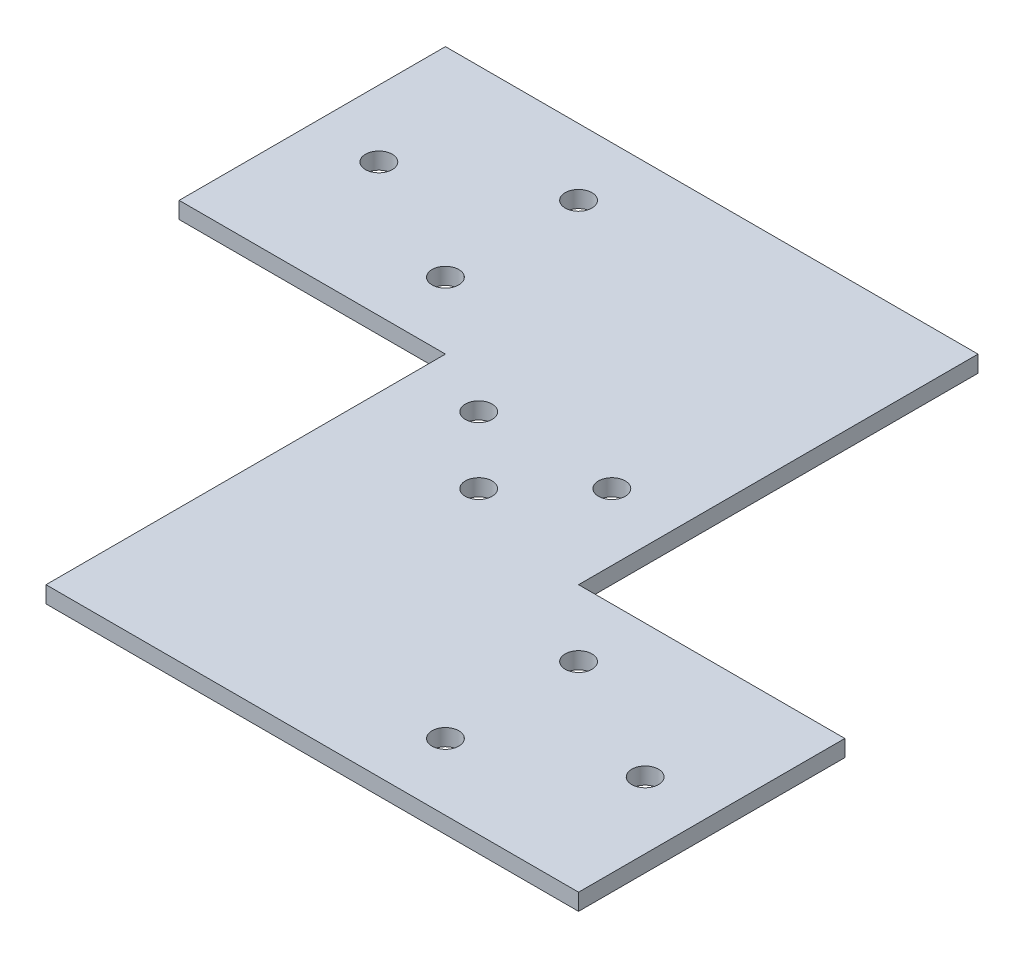
ISO-10303-21;
HEADER;
FILE_DESCRIPTION(('STEP AP214'),'2;1');
FILE_NAME('part.step','',(''),(''),'','','');
FILE_SCHEMA(('AUTOMOTIVE_DESIGN { 1 0 10303 214 1 1 1 1 }'));
ENDSEC;
DATA;
#1=APPLICATION_CONTEXT('core data for automotive mechanical design processes');
#2=APPLICATION_PROTOCOL_DEFINITION('international standard','automotive_design',2000,#1);
#3=PRODUCT_CONTEXT('',#1,'mechanical');
#4=PRODUCT('Part','Part','',(#3));
#5=PRODUCT_RELATED_PRODUCT_CATEGORY('part','',(#4));
#6=PRODUCT_DEFINITION_FORMATION('','',#4);
#7=PRODUCT_DEFINITION_CONTEXT('part definition',#1,'design');
#8=PRODUCT_DEFINITION('design','',#6,#7);
#9=PRODUCT_DEFINITION_SHAPE('','',#8);
#10=(LENGTH_UNIT() NAMED_UNIT(*) SI_UNIT(.MILLI.,.METRE.));
#11=(NAMED_UNIT(*) PLANE_ANGLE_UNIT() SI_UNIT($,.RADIAN.));
#12=(NAMED_UNIT(*) SI_UNIT($,.STERADIAN.) SOLID_ANGLE_UNIT());
#13=UNCERTAINTY_MEASURE_WITH_UNIT(LENGTH_MEASURE(1.E-05),#10,'distance_accuracy_value','');
#14=(GEOMETRIC_REPRESENTATION_CONTEXT(3) GLOBAL_UNCERTAINTY_ASSIGNED_CONTEXT((#13)) GLOBAL_UNIT_ASSIGNED_CONTEXT((#10,
#11,#12)) REPRESENTATION_CONTEXT('',''));
#15=CARTESIAN_POINT('',(0.,0.,0.));
#16=DIRECTION('',(0.,0.,1.));
#17=DIRECTION('',(1.,0.,0.));
#18=AXIS2_PLACEMENT_3D('',#15,#16,#17);
#19=CARTESIAN_POINT('',(0.,3.175,0.));
#20=DIRECTION('',(0.,-1.,0.));
#21=DIRECTION('',(0.,0.,-1.));
#22=AXIS2_PLACEMENT_3D('',#19,#20,#21);
#23=PLANE('',#22);
#24=DIRECTION('',(0.,0.,1.));
#25=VECTOR('',#24,1.);
#26=CARTESIAN_POINT('',(0.,3.175,0.));
#27=LINE('',#26,#25);
#28=CARTESIAN_POINT('',(0.,3.175,-50.8));
#29=VERTEX_POINT('',#28);
#30=CARTESIAN_POINT('',(0.,3.175,0.));
#31=VERTEX_POINT('',#30);
#32=EDGE_CURVE('E145',#29,#31,#27,.T.);
#33=ORIENTED_EDGE('',*,*,#32,.T.);
#34=DIRECTION('',(1.,0.,0.));
#35=VECTOR('',#34,1.);
#36=CARTESIAN_POINT('',(0.,3.175,0.));
#37=LINE('',#36,#35);
#38=CARTESIAN_POINT('',(50.8,3.175,0.));
#39=VERTEX_POINT('',#38);
#40=EDGE_CURVE('E92',#31,#39,#37,.T.);
#41=ORIENTED_EDGE('',*,*,#40,.T.);
#42=DIRECTION('',(0.,0.,1.));
#43=VECTOR('',#42,1.);
#44=CARTESIAN_POINT('',(50.8,3.175,0.));
#45=LINE('',#44,#43);
#46=CARTESIAN_POINT('',(50.8,3.175,76.2));
#47=VERTEX_POINT('',#46);
#48=EDGE_CURVE('E160',#39,#47,#45,.T.);
#49=ORIENTED_EDGE('',*,*,#48,.T.);
#50=DIRECTION('',(1.,0.,0.));
#51=VECTOR('',#50,1.);
#52=CARTESIAN_POINT('',(50.8,3.175,76.2));
#53=LINE('',#52,#51);
#54=CARTESIAN_POINT('',(152.4,3.175,76.2));
#55=VERTEX_POINT('',#54);
#56=EDGE_CURVE('E172',#47,#55,#53,.T.);
#57=ORIENTED_EDGE('',*,*,#56,.T.);
#58=DIRECTION('',(0.,0.,-1.));
#59=VECTOR('',#58,1.);
#60=CARTESIAN_POINT('',(152.4,3.175,76.2));
#61=LINE('',#60,#59);
#62=CARTESIAN_POINT('',(152.4,3.175,25.4));
#63=VERTEX_POINT('',#62);
#64=EDGE_CURVE('E111',#55,#63,#61,.T.);
#65=ORIENTED_EDGE('',*,*,#64,.T.);
#66=DIRECTION('',(-1.,0.,0.));
#67=VECTOR('',#66,1.);
#68=CARTESIAN_POINT('',(101.6,3.175,25.4));
#69=LINE('',#68,#67);
#70=CARTESIAN_POINT('',(101.6,3.175,25.4));
#71=VERTEX_POINT('',#70);
#72=EDGE_CURVE('E105',#63,#71,#69,.T.);
#73=ORIENTED_EDGE('',*,*,#72,.T.);
#74=DIRECTION('',(0.,0.,-1.));
#75=VECTOR('',#74,1.);
#76=CARTESIAN_POINT('',(101.6,3.175,-50.8));
#77=LINE('',#76,#75);
#78=CARTESIAN_POINT('',(101.6,3.175,-50.8));
#79=VERTEX_POINT('',#78);
#80=EDGE_CURVE('E109',#71,#79,#77,.T.);
#81=ORIENTED_EDGE('',*,*,#80,.T.);
#82=DIRECTION('',(-1.,0.,0.));
#83=VECTOR('',#82,1.);
#84=CARTESIAN_POINT('',(0.,3.175,-50.8));
#85=LINE('',#84,#83);
#86=EDGE_CURVE('E49',#79,#29,#85,.T.);
#87=ORIENTED_EDGE('',*,*,#86,.T.);
#88=EDGE_LOOP('',(#33,#41,#49,#57,#65,#73,#81,#87));
#89=FACE_BOUND('',#88,.T.);
#90=CARTESIAN_POINT('',(12.7,3.175,-25.4));
#91=DIRECTION('',(0.,1.,0.));
#92=DIRECTION('',(0.,0.,1.));
#93=AXIS2_PLACEMENT_3D('',#90,#91,#92);
#94=CIRCLE('',#93,2.5527);
#95=CARTESIAN_POINT('',(12.7,3.175,-22.8473));
#96=VERTEX_POINT('',#95);
#97=EDGE_CURVE('E133',#96,#96,#94,.T.);
#98=ORIENTED_EDGE('',*,*,#97,.F.);
#99=EDGE_LOOP('',(#98));
#100=FACE_BOUND('',#99,.T.);
#101=CARTESIAN_POINT('',(38.1,3.175,-12.7));
#102=DIRECTION('',(0.,1.,0.));
#103=DIRECTION('',(0.,0.,1.));
#104=AXIS2_PLACEMENT_3D('',#101,#102,#103);
#105=CIRCLE('',#104,2.5527);
#106=CARTESIAN_POINT('',(38.1,3.175,-10.1473));
#107=VERTEX_POINT('',#106);
#108=EDGE_CURVE('E181',#107,#107,#105,.T.);
#109=ORIENTED_EDGE('',*,*,#108,.F.);
#110=EDGE_LOOP('',(#109));
#111=FACE_BOUND('',#110,.T.);
#112=CARTESIAN_POINT('',(38.1,3.175,-38.1));
#113=DIRECTION('',(0.,1.,0.));
#114=DIRECTION('',(0.,0.,1.));
#115=AXIS2_PLACEMENT_3D('',#112,#113,#114);
#116=CIRCLE('',#115,2.55269999999999);
#117=CARTESIAN_POINT('',(38.1,3.175,-35.5473));
#118=VERTEX_POINT('',#117);
#119=EDGE_CURVE('E187',#118,#118,#116,.T.);
#120=ORIENTED_EDGE('',*,*,#119,.F.);
#121=EDGE_LOOP('',(#120));
#122=FACE_BOUND('',#121,.T.);
#123=CARTESIAN_POINT('',(139.7,3.175,50.8));
#124=DIRECTION('',(0.,1.,0.));
#125=DIRECTION('',(0.,0.,1.));
#126=AXIS2_PLACEMENT_3D('',#123,#124,#125);
#127=CIRCLE('',#126,2.55269999999998);
#128=CARTESIAN_POINT('',(139.7,3.175,53.3527));
#129=VERTEX_POINT('',#128);
#130=EDGE_CURVE('E193',#129,#129,#127,.T.);
#131=ORIENTED_EDGE('',*,*,#130,.F.);
#132=EDGE_LOOP('',(#131));
#133=FACE_BOUND('',#132,.T.);
#134=CARTESIAN_POINT('',(114.3,3.175,38.1));
#135=DIRECTION('',(0.,1.,0.));
#136=DIRECTION('',(0.,0.,1.));
#137=AXIS2_PLACEMENT_3D('',#134,#135,#136);
#138=CIRCLE('',#137,2.55269999999998);
#139=CARTESIAN_POINT('',(114.3,3.175,40.6527));
#140=VERTEX_POINT('',#139);
#141=EDGE_CURVE('E199',#140,#140,#138,.T.);
#142=ORIENTED_EDGE('',*,*,#141,.F.);
#143=EDGE_LOOP('',(#142));
#144=FACE_BOUND('',#143,.T.);
#145=CARTESIAN_POINT('',(114.3,3.175,63.5));
#146=DIRECTION('',(0.,1.,0.));
#147=DIRECTION('',(0.,0.,1.));
#148=AXIS2_PLACEMENT_3D('',#145,#146,#147);
#149=CIRCLE('',#148,2.55269999999998);
#150=CARTESIAN_POINT('',(114.3,3.175,66.0527));
#151=VERTEX_POINT('',#150);
#152=EDGE_CURVE('E205',#151,#151,#149,.T.);
#153=ORIENTED_EDGE('',*,*,#152,.F.);
#154=EDGE_LOOP('',(#153));
#155=FACE_BOUND('',#154,.T.);
#156=CARTESIAN_POINT('',(63.5,3.175,6.35));
#157=DIRECTION('',(0.,1.,0.));
#158=DIRECTION('',(0.,0.,1.));
#159=AXIS2_PLACEMENT_3D('',#156,#157,#158);
#160=CIRCLE('',#159,2.55270000000001);
#161=CARTESIAN_POINT('',(63.5,3.175,8.90270000000001));
#162=VERTEX_POINT('',#161);
#163=EDGE_CURVE('E211',#162,#162,#160,.T.);
#164=ORIENTED_EDGE('',*,*,#163,.F.);
#165=EDGE_LOOP('',(#164));
#166=FACE_BOUND('',#165,.T.);
#167=CARTESIAN_POINT('',(88.9,3.175,6.35));
#168=DIRECTION('',(0.,1.,0.));
#169=DIRECTION('',(0.,0.,1.));
#170=AXIS2_PLACEMENT_3D('',#167,#168,#169);
#171=CIRCLE('',#170,2.55270000000001);
#172=CARTESIAN_POINT('',(88.9,3.175,8.90270000000001));
#173=VERTEX_POINT('',#172);
#174=EDGE_CURVE('E217',#173,#173,#171,.T.);
#175=ORIENTED_EDGE('',*,*,#174,.F.);
#176=EDGE_LOOP('',(#175));
#177=FACE_BOUND('',#176,.T.);
#178=CARTESIAN_POINT('',(76.2,3.175,19.05));
#179=DIRECTION('',(0.,1.,0.));
#180=DIRECTION('',(0.,0.,1.));
#181=AXIS2_PLACEMENT_3D('',#178,#179,#180);
#182=CIRCLE('',#181,2.55270000000001);
#183=CARTESIAN_POINT('',(76.2,3.175,21.6027));
#184=VERTEX_POINT('',#183);
#185=EDGE_CURVE('E223',#184,#184,#182,.T.);
#186=ORIENTED_EDGE('',*,*,#185,.F.);
#187=EDGE_LOOP('',(#186));
#188=FACE_BOUND('',#187,.T.);
#189=ADVANCED_FACE('F32',(#89,#100,#111,#122,#133,#144,#155,#166,#177,#188),#23,.F.);
#190=CARTESIAN_POINT('',(0.,0.,0.));
#191=DIRECTION('',(0.,-1.,0.));
#192=DIRECTION('',(0.,0.,-1.));
#193=AXIS2_PLACEMENT_3D('',#190,#191,#192);
#194=PLANE('',#193);
#195=CARTESIAN_POINT('',(88.9,0.,6.35));
#196=DIRECTION('',(0.,1.,0.));
#197=DIRECTION('',(0.,0.,1.));
#198=AXIS2_PLACEMENT_3D('',#195,#196,#197);
#199=CIRCLE('',#198,2.55270000000001);
#200=CARTESIAN_POINT('',(88.9,0.,8.90270000000001));
#201=VERTEX_POINT('',#200);
#202=EDGE_CURVE('E220',#201,#201,#199,.T.);
#203=ORIENTED_EDGE('',*,*,#202,.T.);
#204=EDGE_LOOP('',(#203));
#205=FACE_BOUND('',#204,.T.);
#206=CARTESIAN_POINT('',(114.3,0.,63.5));
#207=DIRECTION('',(0.,1.,0.));
#208=DIRECTION('',(0.,0.,1.));
#209=AXIS2_PLACEMENT_3D('',#206,#207,#208);
#210=CIRCLE('',#209,2.55269999999998);
#211=CARTESIAN_POINT('',(114.3,0.,66.0527));
#212=VERTEX_POINT('',#211);
#213=EDGE_CURVE('E208',#212,#212,#210,.T.);
#214=ORIENTED_EDGE('',*,*,#213,.T.);
#215=EDGE_LOOP('',(#214));
#216=FACE_BOUND('',#215,.T.);
#217=CARTESIAN_POINT('',(139.7,0.,50.8));
#218=DIRECTION('',(0.,1.,0.));
#219=DIRECTION('',(0.,0.,1.));
#220=AXIS2_PLACEMENT_3D('',#217,#218,#219);
#221=CIRCLE('',#220,2.55269999999998);
#222=CARTESIAN_POINT('',(139.7,0.,53.3527));
#223=VERTEX_POINT('',#222);
#224=EDGE_CURVE('E196',#223,#223,#221,.T.);
#225=ORIENTED_EDGE('',*,*,#224,.T.);
#226=EDGE_LOOP('',(#225));
#227=FACE_BOUND('',#226,.T.);
#228=CARTESIAN_POINT('',(38.1,0.,-12.7));
#229=DIRECTION('',(0.,1.,0.));
#230=DIRECTION('',(0.,0.,1.));
#231=AXIS2_PLACEMENT_3D('',#228,#229,#230);
#232=CIRCLE('',#231,2.5527);
#233=CARTESIAN_POINT('',(38.1,0.,-10.1473));
#234=VERTEX_POINT('',#233);
#235=EDGE_CURVE('E184',#234,#234,#232,.T.);
#236=ORIENTED_EDGE('',*,*,#235,.T.);
#237=EDGE_LOOP('',(#236));
#238=FACE_BOUND('',#237,.T.);
#239=DIRECTION('',(0.,0.,1.));
#240=VECTOR('',#239,1.);
#241=CARTESIAN_POINT('',(0.,0.,0.));
#242=LINE('',#241,#240);
#243=CARTESIAN_POINT('',(0.,0.,-50.8));
#244=VERTEX_POINT('',#243);
#245=CARTESIAN_POINT('',(0.,0.,0.));
#246=VERTEX_POINT('',#245);
#247=EDGE_CURVE('E129',#244,#246,#242,.T.);
#248=ORIENTED_EDGE('',*,*,#247,.F.);
#249=DIRECTION('',(-1.,0.,0.));
#250=VECTOR('',#249,1.);
#251=CARTESIAN_POINT('',(0.,0.,-50.8));
#252=LINE('',#251,#250);
#253=CARTESIAN_POINT('',(101.6,0.,-50.8));
#254=VERTEX_POINT('',#253);
#255=EDGE_CURVE('E84',#254,#244,#252,.T.);
#256=ORIENTED_EDGE('',*,*,#255,.F.);
#257=DIRECTION('',(0.,0.,-1.));
#258=VECTOR('',#257,1.);
#259=CARTESIAN_POINT('',(101.6,0.,-50.8));
#260=LINE('',#259,#258);
#261=CARTESIAN_POINT('',(101.6,0.,25.4));
#262=VERTEX_POINT('',#261);
#263=EDGE_CURVE('E78',#262,#254,#260,.T.);
#264=ORIENTED_EDGE('',*,*,#263,.F.);
#265=DIRECTION('',(-1.,0.,0.));
#266=VECTOR('',#265,1.);
#267=CARTESIAN_POINT('',(101.6,0.,25.4));
#268=LINE('',#267,#266);
#269=CARTESIAN_POINT('',(152.4,0.,25.4));
#270=VERTEX_POINT('',#269);
#271=EDGE_CURVE('E119',#270,#262,#268,.T.);
#272=ORIENTED_EDGE('',*,*,#271,.F.);
#273=DIRECTION('',(0.,0.,-1.));
#274=VECTOR('',#273,1.);
#275=CARTESIAN_POINT('',(152.4,0.,76.2));
#276=LINE('',#275,#274);
#277=CARTESIAN_POINT('',(152.4,0.,76.2));
#278=VERTEX_POINT('',#277);
#279=EDGE_CURVE('E140',#278,#270,#276,.T.);
#280=ORIENTED_EDGE('',*,*,#279,.F.);
#281=DIRECTION('',(1.,0.,0.));
#282=VECTOR('',#281,1.);
#283=CARTESIAN_POINT('',(101.6,0.,76.2));
#284=LINE('',#283,#282);
#285=CARTESIAN_POINT('',(50.8,0.,76.2));
#286=VERTEX_POINT('',#285);
#287=EDGE_CURVE('E138',#286,#278,#284,.T.);
#288=ORIENTED_EDGE('',*,*,#287,.F.);
#289=DIRECTION('',(0.,0.,1.));
#290=VECTOR('',#289,1.);
#291=CARTESIAN_POINT('',(50.8,0.,0.));
#292=LINE('',#291,#290);
#293=CARTESIAN_POINT('',(50.8,0.,0.));
#294=VERTEX_POINT('',#293);
#295=EDGE_CURVE('E135',#294,#286,#292,.T.);
#296=ORIENTED_EDGE('',*,*,#295,.F.);
#297=DIRECTION('',(1.,0.,0.));
#298=VECTOR('',#297,1.);
#299=CARTESIAN_POINT('',(0.,0.,0.));
#300=LINE('',#299,#298);
#301=EDGE_CURVE('E132',#246,#294,#300,.T.);
#302=ORIENTED_EDGE('',*,*,#301,.F.);
#303=EDGE_LOOP('',(#248,#256,#264,#272,#280,#288,#296,#302));
#304=FACE_BOUND('',#303,.T.);
#305=CARTESIAN_POINT('',(12.7,0.,-25.4));
#306=DIRECTION('',(0.,1.,0.));
#307=DIRECTION('',(0.,0.,1.));
#308=AXIS2_PLACEMENT_3D('',#305,#306,#307);
#309=CIRCLE('',#308,2.5527);
#310=CARTESIAN_POINT('',(12.7,0.,-22.8473));
#311=VERTEX_POINT('',#310);
#312=EDGE_CURVE('E178',#311,#311,#309,.T.);
#313=ORIENTED_EDGE('',*,*,#312,.T.);
#314=EDGE_LOOP('',(#313));
#315=FACE_BOUND('',#314,.T.);
#316=CARTESIAN_POINT('',(38.1,0.,-38.1));
#317=DIRECTION('',(0.,1.,0.));
#318=DIRECTION('',(0.,0.,1.));
#319=AXIS2_PLACEMENT_3D('',#316,#317,#318);
#320=CIRCLE('',#319,2.55269999999999);
#321=CARTESIAN_POINT('',(38.1,0.,-35.5473));
#322=VERTEX_POINT('',#321);
#323=EDGE_CURVE('E190',#322,#322,#320,.T.);
#324=ORIENTED_EDGE('',*,*,#323,.T.);
#325=EDGE_LOOP('',(#324));
#326=FACE_BOUND('',#325,.T.);
#327=CARTESIAN_POINT('',(114.3,0.,38.1));
#328=DIRECTION('',(0.,1.,0.));
#329=DIRECTION('',(0.,0.,1.));
#330=AXIS2_PLACEMENT_3D('',#327,#328,#329);
#331=CIRCLE('',#330,2.55269999999998);
#332=CARTESIAN_POINT('',(114.3,0.,40.6527));
#333=VERTEX_POINT('',#332);
#334=EDGE_CURVE('E202',#333,#333,#331,.T.);
#335=ORIENTED_EDGE('',*,*,#334,.T.);
#336=EDGE_LOOP('',(#335));
#337=FACE_BOUND('',#336,.T.);
#338=CARTESIAN_POINT('',(63.5,0.,6.35));
#339=DIRECTION('',(0.,1.,0.));
#340=DIRECTION('',(0.,0.,1.));
#341=AXIS2_PLACEMENT_3D('',#338,#339,#340);
#342=CIRCLE('',#341,2.55270000000001);
#343=CARTESIAN_POINT('',(63.5,0.,8.90270000000001));
#344=VERTEX_POINT('',#343);
#345=EDGE_CURVE('E214',#344,#344,#342,.T.);
#346=ORIENTED_EDGE('',*,*,#345,.T.);
#347=EDGE_LOOP('',(#346));
#348=FACE_BOUND('',#347,.T.);
#349=CARTESIAN_POINT('',(76.2,0.,19.05));
#350=DIRECTION('',(0.,1.,0.));
#351=DIRECTION('',(0.,0.,1.));
#352=AXIS2_PLACEMENT_3D('',#349,#350,#351);
#353=CIRCLE('',#352,2.55270000000001);
#354=CARTESIAN_POINT('',(76.2,0.,21.6027));
#355=VERTEX_POINT('',#354);
#356=EDGE_CURVE('E226',#355,#355,#353,.T.);
#357=ORIENTED_EDGE('',*,*,#356,.T.);
#358=EDGE_LOOP('',(#357));
#359=FACE_BOUND('',#358,.T.);
#360=ADVANCED_FACE('F163',(#205,#216,#227,#238,#304,#315,#326,#337,#348,#359),#194,.T.);
#361=CARTESIAN_POINT('',(0.,3.175,0.));
#362=DIRECTION('',(1.,0.,0.));
#363=DIRECTION('',(0.,0.,-1.));
#364=AXIS2_PLACEMENT_3D('',#361,#362,#363);
#365=PLANE('',#364);
#366=ORIENTED_EDGE('',*,*,#247,.T.);
#367=DIRECTION('',(0.,-1.,0.));
#368=VECTOR('',#367,1.);
#369=CARTESIAN_POINT('',(0.,3.175,0.));
#370=LINE('',#369,#368);
#371=EDGE_CURVE('E11',#31,#246,#370,.T.);
#372=ORIENTED_EDGE('',*,*,#371,.F.);
#373=ORIENTED_EDGE('',*,*,#32,.F.);
#374=DIRECTION('',(0.,-1.,0.));
#375=VECTOR('',#374,1.);
#376=CARTESIAN_POINT('',(0.,3.175,-50.8));
#377=LINE('',#376,#375);
#378=EDGE_CURVE('E125',#29,#244,#377,.T.);
#379=ORIENTED_EDGE('',*,*,#378,.T.);
#380=EDGE_LOOP('',(#366,#372,#373,#379));
#381=FACE_BOUND('',#380,.T.);
#382=ADVANCED_FACE('F34',(#381),#365,.F.);
#383=CARTESIAN_POINT('',(0.,3.175,0.));
#384=DIRECTION('',(0.,0.,-1.));
#385=DIRECTION('',(-1.,0.,0.));
#386=AXIS2_PLACEMENT_3D('',#383,#384,#385);
#387=PLANE('',#386);
#388=ORIENTED_EDGE('',*,*,#301,.T.);
#389=DIRECTION('',(0.,-1.,0.));
#390=VECTOR('',#389,1.);
#391=CARTESIAN_POINT('',(50.8,3.175,0.));
#392=LINE('',#391,#390);
#393=EDGE_CURVE('E41',#39,#294,#392,.T.);
#394=ORIENTED_EDGE('',*,*,#393,.F.);
#395=ORIENTED_EDGE('',*,*,#40,.F.);
#396=ORIENTED_EDGE('',*,*,#371,.T.);
#397=EDGE_LOOP('',(#388,#394,#395,#396));
#398=FACE_BOUND('',#397,.T.);
#399=ADVANCED_FACE('F258',(#398),#387,.F.);
#400=CARTESIAN_POINT('',(50.8,3.175,0.));
#401=DIRECTION('',(1.,0.,0.));
#402=DIRECTION('',(0.,0.,-1.));
#403=AXIS2_PLACEMENT_3D('',#400,#401,#402);
#404=PLANE('',#403);
#405=ORIENTED_EDGE('',*,*,#295,.T.);
#406=DIRECTION('',(0.,-1.,0.));
#407=VECTOR('',#406,1.);
#408=CARTESIAN_POINT('',(50.8,3.175,76.2));
#409=LINE('',#408,#407);
#410=EDGE_CURVE('E152',#47,#286,#409,.T.);
#411=ORIENTED_EDGE('',*,*,#410,.F.);
#412=ORIENTED_EDGE('',*,*,#48,.F.);
#413=ORIENTED_EDGE('',*,*,#393,.T.);
#414=EDGE_LOOP('',(#405,#411,#412,#413));
#415=FACE_BOUND('',#414,.T.);
#416=ADVANCED_FACE('F158',(#415),#404,.F.);
#417=CARTESIAN_POINT('',(101.6,3.175,76.2));
#418=DIRECTION('',(0.,0.,-1.));
#419=DIRECTION('',(-1.,0.,0.));
#420=AXIS2_PLACEMENT_3D('',#417,#418,#419);
#421=PLANE('',#420);
#422=ORIENTED_EDGE('',*,*,#287,.T.);
#423=DIRECTION('',(0.,-1.,0.));
#424=VECTOR('',#423,1.);
#425=CARTESIAN_POINT('',(152.4,3.175,76.2));
#426=LINE('',#425,#424);
#427=EDGE_CURVE('E149',#55,#278,#426,.T.);
#428=ORIENTED_EDGE('',*,*,#427,.F.);
#429=ORIENTED_EDGE('',*,*,#56,.F.);
#430=ORIENTED_EDGE('',*,*,#410,.T.);
#431=EDGE_LOOP('',(#422,#428,#429,#430));
#432=FACE_BOUND('',#431,.T.);
#433=ADVANCED_FACE('F168',(#432),#421,.F.);
#434=CARTESIAN_POINT('',(152.4,3.175,76.2));
#435=DIRECTION('',(-1.,0.,0.));
#436=DIRECTION('',(0.,0.,1.));
#437=AXIS2_PLACEMENT_3D('',#434,#435,#436);
#438=PLANE('',#437);
#439=ORIENTED_EDGE('',*,*,#279,.T.);
#440=DIRECTION('',(0.,-1.,0.));
#441=VECTOR('',#440,1.);
#442=CARTESIAN_POINT('',(152.4,3.175,25.4));
#443=LINE('',#442,#441);
#444=EDGE_CURVE('E120',#63,#270,#443,.T.);
#445=ORIENTED_EDGE('',*,*,#444,.F.);
#446=ORIENTED_EDGE('',*,*,#64,.F.);
#447=ORIENTED_EDGE('',*,*,#427,.T.);
#448=EDGE_LOOP('',(#439,#445,#446,#447));
#449=FACE_BOUND('',#448,.T.);
#450=ADVANCED_FACE('F171',(#449),#438,.F.);
#451=CARTESIAN_POINT('',(101.6,3.175,25.4));
#452=DIRECTION('',(0.,0.,1.));
#453=DIRECTION('',(1.,0.,0.));
#454=AXIS2_PLACEMENT_3D('',#451,#452,#453);
#455=PLANE('',#454);
#456=ORIENTED_EDGE('',*,*,#271,.T.);
#457=DIRECTION('',(0.,-1.,0.));
#458=VECTOR('',#457,1.);
#459=CARTESIAN_POINT('',(101.6,3.175,25.4));
#460=LINE('',#459,#458);
#461=EDGE_CURVE('E116',#71,#262,#460,.T.);
#462=ORIENTED_EDGE('',*,*,#461,.F.);
#463=ORIENTED_EDGE('',*,*,#72,.F.);
#464=ORIENTED_EDGE('',*,*,#444,.T.);
#465=EDGE_LOOP('',(#456,#462,#463,#464));
#466=FACE_BOUND('',#465,.T.);
#467=ADVANCED_FACE('F117',(#466),#455,.F.);
#468=CARTESIAN_POINT('',(101.6,3.175,-50.8));
#469=DIRECTION('',(-1.,0.,0.));
#470=DIRECTION('',(0.,0.,1.));
#471=AXIS2_PLACEMENT_3D('',#468,#469,#470);
#472=PLANE('',#471);
#473=ORIENTED_EDGE('',*,*,#263,.T.);
#474=DIRECTION('',(0.,-1.,0.));
#475=VECTOR('',#474,1.);
#476=CARTESIAN_POINT('',(101.6,3.175,-50.8));
#477=LINE('',#476,#475);
#478=EDGE_CURVE('E121',#79,#254,#477,.T.);
#479=ORIENTED_EDGE('',*,*,#478,.F.);
#480=ORIENTED_EDGE('',*,*,#80,.F.);
#481=ORIENTED_EDGE('',*,*,#461,.T.);
#482=EDGE_LOOP('',(#473,#479,#480,#481));
#483=FACE_BOUND('',#482,.T.);
#484=ADVANCED_FACE('F123',(#483),#472,.F.);
#485=CARTESIAN_POINT('',(0.,3.175,-50.8));
#486=DIRECTION('',(0.,0.,1.));
#487=DIRECTION('',(1.,0.,0.));
#488=AXIS2_PLACEMENT_3D('',#485,#486,#487);
#489=PLANE('',#488);
#490=ORIENTED_EDGE('',*,*,#255,.T.);
#491=ORIENTED_EDGE('',*,*,#378,.F.);
#492=ORIENTED_EDGE('',*,*,#86,.F.);
#493=ORIENTED_EDGE('',*,*,#478,.T.);
#494=EDGE_LOOP('',(#490,#491,#492,#493));
#495=FACE_BOUND('',#494,.T.);
#496=ADVANCED_FACE('F246',(#495),#489,.F.);
#497=CARTESIAN_POINT('',(12.7,3.175,-25.4));
#498=DIRECTION('',(0.,-1.,0.));
#499=DIRECTION('',(0.,0.,-1.));
#500=AXIS2_PLACEMENT_3D('',#497,#498,#499);
#501=CYLINDRICAL_SURFACE('',#500,2.5527);
#502=ORIENTED_EDGE('',*,*,#97,.T.);
#503=EDGE_LOOP('',(#502));
#504=FACE_BOUND('',#503,.T.);
#505=ORIENTED_EDGE('',*,*,#312,.F.);
#506=EDGE_LOOP('',(#505));
#507=FACE_BOUND('',#506,.T.);
#508=ADVANCED_FACE('F243',(#504,#507),#501,.F.);
#509=CARTESIAN_POINT('',(38.1,3.175,-12.7));
#510=DIRECTION('',(0.,-1.,0.));
#511=DIRECTION('',(0.,0.,-1.));
#512=AXIS2_PLACEMENT_3D('',#509,#510,#511);
#513=CYLINDRICAL_SURFACE('',#512,2.5527);
#514=ORIENTED_EDGE('',*,*,#108,.T.);
#515=EDGE_LOOP('',(#514));
#516=FACE_BOUND('',#515,.T.);
#517=ORIENTED_EDGE('',*,*,#235,.F.);
#518=EDGE_LOOP('',(#517));
#519=FACE_BOUND('',#518,.T.);
#520=ADVANCED_FACE('F325',(#516,#519),#513,.F.);
#521=CARTESIAN_POINT('',(38.1,3.175,-38.1));
#522=DIRECTION('',(0.,-1.,0.));
#523=DIRECTION('',(0.,0.,-1.));
#524=AXIS2_PLACEMENT_3D('',#521,#522,#523);
#525=CYLINDRICAL_SURFACE('',#524,2.55269999999999);
#526=ORIENTED_EDGE('',*,*,#119,.T.);
#527=EDGE_LOOP('',(#526));
#528=FACE_BOUND('',#527,.T.);
#529=ORIENTED_EDGE('',*,*,#323,.F.);
#530=EDGE_LOOP('',(#529));
#531=FACE_BOUND('',#530,.T.);
#532=ADVANCED_FACE('F333',(#528,#531),#525,.F.);
#533=CARTESIAN_POINT('',(139.7,3.175,50.8));
#534=DIRECTION('',(0.,-1.,0.));
#535=DIRECTION('',(0.,0.,-1.));
#536=AXIS2_PLACEMENT_3D('',#533,#534,#535);
#537=CYLINDRICAL_SURFACE('',#536,2.55269999999998);
#538=ORIENTED_EDGE('',*,*,#130,.T.);
#539=EDGE_LOOP('',(#538));
#540=FACE_BOUND('',#539,.T.);
#541=ORIENTED_EDGE('',*,*,#224,.F.);
#542=EDGE_LOOP('',(#541));
#543=FACE_BOUND('',#542,.T.);
#544=ADVANCED_FACE('F341',(#540,#543),#537,.F.);
#545=CARTESIAN_POINT('',(114.3,3.175,38.1));
#546=DIRECTION('',(0.,-1.,0.));
#547=DIRECTION('',(0.,0.,-1.));
#548=AXIS2_PLACEMENT_3D('',#545,#546,#547);
#549=CYLINDRICAL_SURFACE('',#548,2.55269999999998);
#550=ORIENTED_EDGE('',*,*,#141,.T.);
#551=EDGE_LOOP('',(#550));
#552=FACE_BOUND('',#551,.T.);
#553=ORIENTED_EDGE('',*,*,#334,.F.);
#554=EDGE_LOOP('',(#553));
#555=FACE_BOUND('',#554,.T.);
#556=ADVANCED_FACE('F350',(#552,#555),#549,.F.);
#557=CARTESIAN_POINT('',(114.3,3.175,63.5));
#558=DIRECTION('',(0.,-1.,0.));
#559=DIRECTION('',(0.,0.,-1.));
#560=AXIS2_PLACEMENT_3D('',#557,#558,#559);
#561=CYLINDRICAL_SURFACE('',#560,2.55269999999998);
#562=ORIENTED_EDGE('',*,*,#152,.T.);
#563=EDGE_LOOP('',(#562));
#564=FACE_BOUND('',#563,.T.);
#565=ORIENTED_EDGE('',*,*,#213,.F.);
#566=EDGE_LOOP('',(#565));
#567=FACE_BOUND('',#566,.T.);
#568=ADVANCED_FACE('F359',(#564,#567),#561,.F.);
#569=CARTESIAN_POINT('',(63.5,3.175,6.35));
#570=DIRECTION('',(0.,-1.,0.));
#571=DIRECTION('',(0.,0.,-1.));
#572=AXIS2_PLACEMENT_3D('',#569,#570,#571);
#573=CYLINDRICAL_SURFACE('',#572,2.55270000000001);
#574=ORIENTED_EDGE('',*,*,#163,.T.);
#575=EDGE_LOOP('',(#574));
#576=FACE_BOUND('',#575,.T.);
#577=ORIENTED_EDGE('',*,*,#345,.F.);
#578=EDGE_LOOP('',(#577));
#579=FACE_BOUND('',#578,.T.);
#580=ADVANCED_FACE('F368',(#576,#579),#573,.F.);
#581=CARTESIAN_POINT('',(88.9,3.175,6.35));
#582=DIRECTION('',(0.,-1.,0.));
#583=DIRECTION('',(0.,0.,-1.));
#584=AXIS2_PLACEMENT_3D('',#581,#582,#583);
#585=CYLINDRICAL_SURFACE('',#584,2.55270000000001);
#586=ORIENTED_EDGE('',*,*,#174,.T.);
#587=EDGE_LOOP('',(#586));
#588=FACE_BOUND('',#587,.T.);
#589=ORIENTED_EDGE('',*,*,#202,.F.);
#590=EDGE_LOOP('',(#589));
#591=FACE_BOUND('',#590,.T.);
#592=ADVANCED_FACE('F377',(#588,#591),#585,.F.);
#593=CARTESIAN_POINT('',(76.2,3.175,19.05));
#594=DIRECTION('',(0.,-1.,0.));
#595=DIRECTION('',(0.,0.,-1.));
#596=AXIS2_PLACEMENT_3D('',#593,#594,#595);
#597=CYLINDRICAL_SURFACE('',#596,2.55270000000001);
#598=ORIENTED_EDGE('',*,*,#185,.T.);
#599=EDGE_LOOP('',(#598));
#600=FACE_BOUND('',#599,.T.);
#601=ORIENTED_EDGE('',*,*,#356,.F.);
#602=EDGE_LOOP('',(#601));
#603=FACE_BOUND('',#602,.T.);
#604=ADVANCED_FACE('F232',(#600,#603),#597,.F.);
#605=CLOSED_SHELL('',(#189,#360,#382,#399,#416,#433,#450,#467,#484,#496,#508,#520,#532,#544,
#556,#568,#580,#592,#604));
#606=MANIFOLD_SOLID_BREP('B2',#605);
#607=ADVANCED_BREP_SHAPE_REPRESENTATION('',(#18,#606),#14);
#608=SHAPE_DEFINITION_REPRESENTATION(#9,#607);
ENDSEC;
END-ISO-10303-21;
